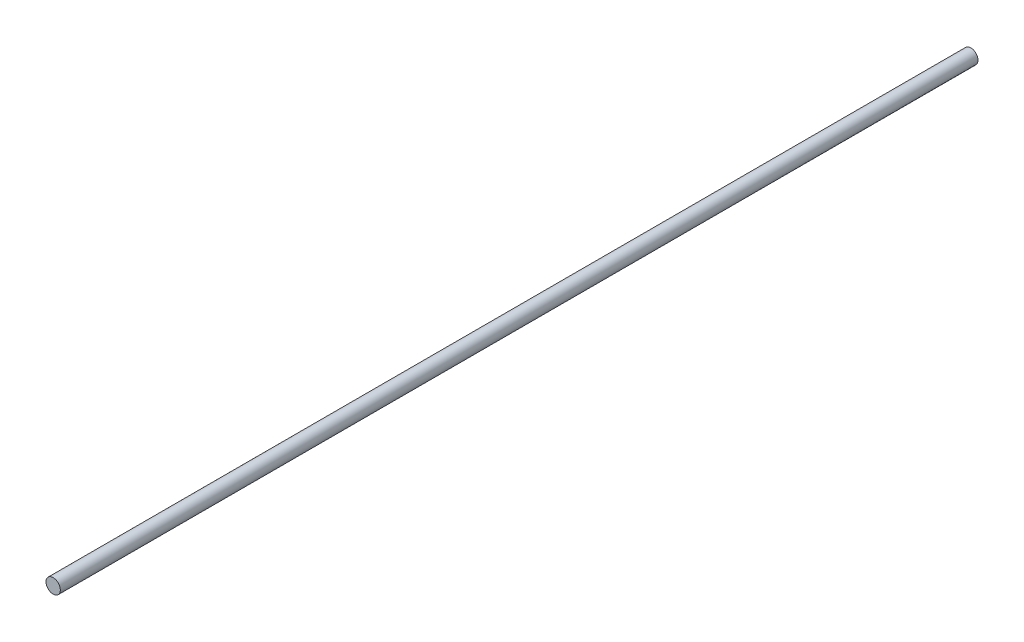
ISO-10303-21;
HEADER;
FILE_DESCRIPTION(('STEP AP214'),'2;1');
FILE_NAME('part.step','',(''),(''),'','','');
FILE_SCHEMA(('AUTOMOTIVE_DESIGN { 1 0 10303 214 1 1 1 1 }'));
ENDSEC;
DATA;
#1=APPLICATION_CONTEXT('core data for automotive mechanical design processes');
#2=APPLICATION_PROTOCOL_DEFINITION('international standard','automotive_design',2000,#1);
#3=PRODUCT_CONTEXT('',#1,'mechanical');
#4=PRODUCT('Part','Part','',(#3));
#5=PRODUCT_RELATED_PRODUCT_CATEGORY('part','',(#4));
#6=PRODUCT_DEFINITION_FORMATION('','',#4);
#7=PRODUCT_DEFINITION_CONTEXT('part definition',#1,'design');
#8=PRODUCT_DEFINITION('design','',#6,#7);
#9=PRODUCT_DEFINITION_SHAPE('','',#8);
#10=(LENGTH_UNIT() NAMED_UNIT(*) SI_UNIT(.MILLI.,.METRE.));
#11=(NAMED_UNIT(*) PLANE_ANGLE_UNIT() SI_UNIT($,.RADIAN.));
#12=(NAMED_UNIT(*) SI_UNIT($,.STERADIAN.) SOLID_ANGLE_UNIT());
#13=UNCERTAINTY_MEASURE_WITH_UNIT(LENGTH_MEASURE(1.E-05),#10,'distance_accuracy_value','');
#14=(GEOMETRIC_REPRESENTATION_CONTEXT(3) GLOBAL_UNCERTAINTY_ASSIGNED_CONTEXT((#13)) GLOBAL_UNIT_ASSIGNED_CONTEXT((#10,
#11,#12)) REPRESENTATION_CONTEXT('',''));
#15=CARTESIAN_POINT('',(0.,0.,0.));
#16=DIRECTION('',(0.,0.,1.));
#17=DIRECTION('',(1.,0.,0.));
#18=AXIS2_PLACEMENT_3D('',#15,#16,#17);
#19=CARTESIAN_POINT('',(0.,0.,512.));
#20=DIRECTION('',(0.,0.,-1.));
#21=DIRECTION('',(-1.,0.,0.));
#22=AXIS2_PLACEMENT_3D('',#19,#20,#21);
#23=CYLINDRICAL_SURFACE('',#22,4.);
#24=CARTESIAN_POINT('',(0.,0.,512.));
#25=DIRECTION('',(0.,0.,1.));
#26=DIRECTION('',(1.,0.,0.));
#27=AXIS2_PLACEMENT_3D('',#24,#25,#26);
#28=CIRCLE('',#27,4.);
#29=CARTESIAN_POINT('',(4.,0.,512.));
#30=VERTEX_POINT('',#29);
#31=EDGE_CURVE('E10',#30,#30,#28,.T.);
#32=ORIENTED_EDGE('',*,*,#31,.F.);
#33=EDGE_LOOP('',(#32));
#34=FACE_BOUND('',#33,.T.);
#35=CARTESIAN_POINT('',(0.,0.,0.));
#36=DIRECTION('',(0.,0.,1.));
#37=DIRECTION('',(1.,0.,0.));
#38=AXIS2_PLACEMENT_3D('',#35,#36,#37);
#39=CIRCLE('',#38,4.);
#40=CARTESIAN_POINT('',(4.,0.,0.));
#41=VERTEX_POINT('',#40);
#42=EDGE_CURVE('E42',#41,#41,#39,.T.);
#43=ORIENTED_EDGE('',*,*,#42,.T.);
#44=EDGE_LOOP('',(#43));
#45=FACE_BOUND('',#44,.T.);
#46=ADVANCED_FACE('F39',(#34,#45),#23,.T.);
#47=CARTESIAN_POINT('',(0.,0.,512.));
#48=DIRECTION('',(0.,0.,1.));
#49=DIRECTION('',(1.,0.,0.));
#50=AXIS2_PLACEMENT_3D('',#47,#48,#49);
#51=PLANE('',#50);
#52=ORIENTED_EDGE('',*,*,#31,.T.);
#53=EDGE_LOOP('',(#52));
#54=FACE_BOUND('',#53,.T.);
#55=ADVANCED_FACE('F56',(#54),#51,.T.);
#56=CARTESIAN_POINT('',(0.,0.,0.));
#57=DIRECTION('',(0.,0.,1.));
#58=DIRECTION('',(1.,0.,0.));
#59=AXIS2_PLACEMENT_3D('',#56,#57,#58);
#60=PLANE('',#59);
#61=ORIENTED_EDGE('',*,*,#42,.F.);
#62=EDGE_LOOP('',(#61));
#63=FACE_BOUND('',#62,.T.);
#64=ADVANCED_FACE('F54',(#63),#60,.F.);
#65=CLOSED_SHELL('',(#46,#55,#64));
#66=MANIFOLD_SOLID_BREP('B2',#65);
#67=ADVANCED_BREP_SHAPE_REPRESENTATION('',(#18,#66),#14);
#68=SHAPE_DEFINITION_REPRESENTATION(#9,#67);
ENDSEC;
END-ISO-10303-21;
